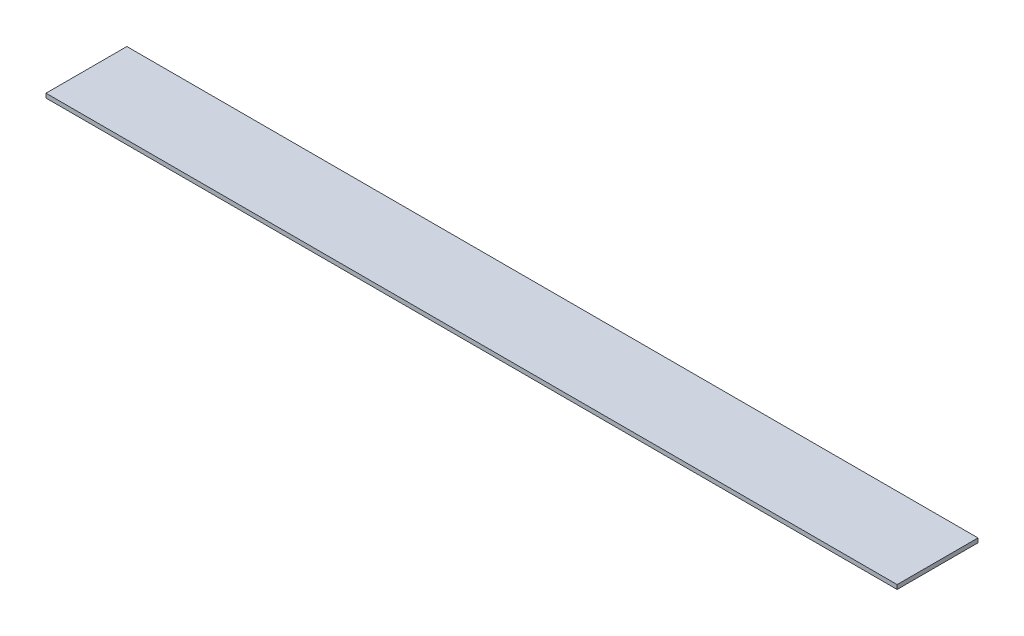
ISO-10303-21;
HEADER;
FILE_DESCRIPTION(('STEP AP214'),'2;1');
FILE_NAME('part.step','',(''),(''),'','','');
FILE_SCHEMA(('AUTOMOTIVE_DESIGN { 1 0 10303 214 1 1 1 1 }'));
ENDSEC;
DATA;
#1=APPLICATION_CONTEXT('core data for automotive mechanical design processes');
#2=APPLICATION_PROTOCOL_DEFINITION('international standard','automotive_design',2000,#1);
#3=PRODUCT_CONTEXT('',#1,'mechanical');
#4=PRODUCT('Part','Part','',(#3));
#5=PRODUCT_RELATED_PRODUCT_CATEGORY('part','',(#4));
#6=PRODUCT_DEFINITION_FORMATION('','',#4);
#7=PRODUCT_DEFINITION_CONTEXT('part definition',#1,'design');
#8=PRODUCT_DEFINITION('design','',#6,#7);
#9=PRODUCT_DEFINITION_SHAPE('','',#8);
#10=(LENGTH_UNIT() NAMED_UNIT(*) SI_UNIT(.MILLI.,.METRE.));
#11=(NAMED_UNIT(*) PLANE_ANGLE_UNIT() SI_UNIT($,.RADIAN.));
#12=(NAMED_UNIT(*) SI_UNIT($,.STERADIAN.) SOLID_ANGLE_UNIT());
#13=UNCERTAINTY_MEASURE_WITH_UNIT(LENGTH_MEASURE(1.E-05),#10,'distance_accuracy_value','');
#14=(GEOMETRIC_REPRESENTATION_CONTEXT(3) GLOBAL_UNCERTAINTY_ASSIGNED_CONTEXT((#13)) GLOBAL_UNIT_ASSIGNED_CONTEXT((#10,
#11,#12)) REPRESENTATION_CONTEXT('',''));
#15=CARTESIAN_POINT('',(0.,0.,0.));
#16=DIRECTION('',(0.,0.,1.));
#17=DIRECTION('',(1.,0.,0.));
#18=AXIS2_PLACEMENT_3D('',#15,#16,#17);
#19=CARTESIAN_POINT('',(-300.,0.,0.));
#20=DIRECTION('',(-1.,0.,0.));
#21=DIRECTION('',(0.,0.,1.));
#22=AXIS2_PLACEMENT_3D('',#19,#20,#21);
#23=PLANE('',#22);
#24=DIRECTION('',(0.,1.,0.));
#25=VECTOR('',#24,1.);
#26=CARTESIAN_POINT('',(-300.,0.,3.));
#27=LINE('',#26,#25);
#28=CARTESIAN_POINT('',(-300.,-50.,3.));
#29=VERTEX_POINT('',#28);
#30=CARTESIAN_POINT('',(-300.,-47.,3.));
#31=VERTEX_POINT('',#30);
#32=EDGE_CURVE('E11',#29,#31,#27,.T.);
#33=ORIENTED_EDGE('',*,*,#32,.F.);
#34=DIRECTION('',(0.,0.,-1.));
#35=VECTOR('',#34,1.);
#36=CARTESIAN_POINT('',(-300.,-50.,60.));
#37=LINE('',#36,#35);
#38=CARTESIAN_POINT('',(-300.,-50.,60.));
#39=VERTEX_POINT('',#38);
#40=EDGE_CURVE('E71',#39,#29,#37,.T.);
#41=ORIENTED_EDGE('',*,*,#40,.F.);
#42=DIRECTION('',(0.,-1.,0.));
#43=VECTOR('',#42,1.);
#44=CARTESIAN_POINT('',(-300.,0.,60.));
#45=LINE('',#44,#43);
#46=CARTESIAN_POINT('',(-300.,-47.,60.));
#47=VERTEX_POINT('',#46);
#48=EDGE_CURVE('E74',#47,#39,#45,.T.);
#49=ORIENTED_EDGE('',*,*,#48,.F.);
#50=DIRECTION('',(0.,0.,1.));
#51=VECTOR('',#50,1.);
#52=CARTESIAN_POINT('',(-300.,-47.,3.));
#53=LINE('',#52,#51);
#54=EDGE_CURVE('E91',#31,#47,#53,.T.);
#55=ORIENTED_EDGE('',*,*,#54,.F.);
#56=EDGE_LOOP('',(#33,#41,#49,#55));
#57=FACE_BOUND('',#56,.T.);
#58=ADVANCED_FACE('F32',(#57),#23,.T.);
#59=CARTESIAN_POINT('',(-300.,0.,60.));
#60=DIRECTION('',(0.,0.,1.));
#61=DIRECTION('',(1.,0.,0.));
#62=AXIS2_PLACEMENT_3D('',#59,#60,#61);
#63=PLANE('',#62);
#64=DIRECTION('',(1.,0.,0.));
#65=VECTOR('',#64,1.);
#66=CARTESIAN_POINT('',(-300.,-47.,60.));
#67=LINE('',#66,#65);
#68=CARTESIAN_POINT('',(300.,-47.,60.));
#69=VERTEX_POINT('',#68);
#70=EDGE_CURVE('E84',#47,#69,#67,.T.);
#71=ORIENTED_EDGE('',*,*,#70,.F.);
#72=ORIENTED_EDGE('',*,*,#48,.T.);
#73=DIRECTION('',(1.,0.,0.));
#74=VECTOR('',#73,1.);
#75=CARTESIAN_POINT('',(-300.,-50.,60.));
#76=LINE('',#75,#74);
#77=CARTESIAN_POINT('',(300.,-50.,60.));
#78=VERTEX_POINT('',#77);
#79=EDGE_CURVE('E77',#39,#78,#76,.T.);
#80=ORIENTED_EDGE('',*,*,#79,.T.);
#81=DIRECTION('',(0.,-1.,0.));
#82=VECTOR('',#81,1.);
#83=CARTESIAN_POINT('',(300.,3.43367945760358E-13,60.));
#84=LINE('',#83,#82);
#85=EDGE_CURVE('E85',#69,#78,#84,.T.);
#86=ORIENTED_EDGE('',*,*,#85,.F.);
#87=EDGE_LOOP('',(#71,#72,#80,#86));
#88=FACE_BOUND('',#87,.T.);
#89=ADVANCED_FACE('F81',(#88),#63,.T.);
#90=CARTESIAN_POINT('',(0.,0.,3.));
#91=DIRECTION('',(0.,0.,1.));
#92=DIRECTION('',(1.,0.,0.));
#93=AXIS2_PLACEMENT_3D('',#90,#91,#92);
#94=PLANE('',#93);
#95=ORIENTED_EDGE('',*,*,#32,.T.);
#96=DIRECTION('',(-1.,0.,0.));
#97=VECTOR('',#96,1.);
#98=CARTESIAN_POINT('',(-300.,-47.,3.));
#99=LINE('',#98,#97);
#100=CARTESIAN_POINT('',(300.,-47.,3.));
#101=VERTEX_POINT('',#100);
#102=EDGE_CURVE('E99',#101,#31,#99,.T.);
#103=ORIENTED_EDGE('',*,*,#102,.F.);
#104=DIRECTION('',(0.,1.,0.));
#105=VECTOR('',#104,1.);
#106=CARTESIAN_POINT('',(300.,1.71683972880179E-13,3.));
#107=LINE('',#106,#105);
#108=CARTESIAN_POINT('',(300.,-50.,3.));
#109=VERTEX_POINT('',#108);
#110=EDGE_CURVE('E41',#109,#101,#107,.T.);
#111=ORIENTED_EDGE('',*,*,#110,.F.);
#112=DIRECTION('',(1.,0.,0.));
#113=VECTOR('',#112,1.);
#114=CARTESIAN_POINT('',(-300.,-50.,3.));
#115=LINE('',#114,#113);
#116=EDGE_CURVE('E36',#29,#109,#115,.T.);
#117=ORIENTED_EDGE('',*,*,#116,.F.);
#118=EDGE_LOOP('',(#95,#103,#111,#117));
#119=FACE_BOUND('',#118,.T.);
#120=ADVANCED_FACE('F34',(#119),#94,.F.);
#121=CARTESIAN_POINT('',(-300.,-50.,60.));
#122=DIRECTION('',(0.,1.,0.));
#123=DIRECTION('',(0.,0.,1.));
#124=AXIS2_PLACEMENT_3D('',#121,#122,#123);
#125=PLANE('',#124);
#126=ORIENTED_EDGE('',*,*,#40,.T.);
#127=ORIENTED_EDGE('',*,*,#116,.T.);
#128=DIRECTION('',(0.,0.,-1.));
#129=VECTOR('',#128,1.);
#130=CARTESIAN_POINT('',(300.,-50.,60.));
#131=LINE('',#130,#129);
#132=EDGE_CURVE('E89',#78,#109,#131,.T.);
#133=ORIENTED_EDGE('',*,*,#132,.F.);
#134=ORIENTED_EDGE('',*,*,#79,.F.);
#135=EDGE_LOOP('',(#126,#127,#133,#134));
#136=FACE_BOUND('',#135,.T.);
#137=ADVANCED_FACE('F87',(#136),#125,.F.);
#138=CARTESIAN_POINT('',(-300.,-47.,3.));
#139=DIRECTION('',(0.,-1.,0.));
#140=DIRECTION('',(0.,0.,-1.));
#141=AXIS2_PLACEMENT_3D('',#138,#139,#140);
#142=PLANE('',#141);
#143=DIRECTION('',(0.,0.,1.));
#144=VECTOR('',#143,1.);
#145=CARTESIAN_POINT('',(300.,-47.,3.));
#146=LINE('',#145,#144);
#147=EDGE_CURVE('E96',#101,#69,#146,.T.);
#148=ORIENTED_EDGE('',*,*,#147,.F.);
#149=ORIENTED_EDGE('',*,*,#102,.T.);
#150=ORIENTED_EDGE('',*,*,#54,.T.);
#151=ORIENTED_EDGE('',*,*,#70,.T.);
#152=EDGE_LOOP('',(#148,#149,#150,#151));
#153=FACE_BOUND('',#152,.T.);
#154=ADVANCED_FACE('F105',(#153),#142,.F.);
#155=CARTESIAN_POINT('',(300.,1.71683972880179E-13,0.));
#156=DIRECTION('',(-1.,0.,0.));
#157=DIRECTION('',(0.,-1.,0.));
#158=AXIS2_PLACEMENT_3D('',#155,#156,#157);
#159=PLANE('',#158);
#160=ORIENTED_EDGE('',*,*,#132,.T.);
#161=ORIENTED_EDGE('',*,*,#110,.T.);
#162=ORIENTED_EDGE('',*,*,#147,.T.);
#163=ORIENTED_EDGE('',*,*,#85,.T.);
#164=EDGE_LOOP('',(#160,#161,#162,#163));
#165=FACE_BOUND('',#164,.T.);
#166=ADVANCED_FACE('F102',(#165),#159,.F.);
#167=CLOSED_SHELL('',(#58,#89,#120,#137,#154,#166));
#168=MANIFOLD_SOLID_BREP('B2',#167);
#169=ADVANCED_BREP_SHAPE_REPRESENTATION('',(#18,#168),#14);
#170=SHAPE_DEFINITION_REPRESENTATION(#9,#169);
ENDSEC;
END-ISO-10303-21;
